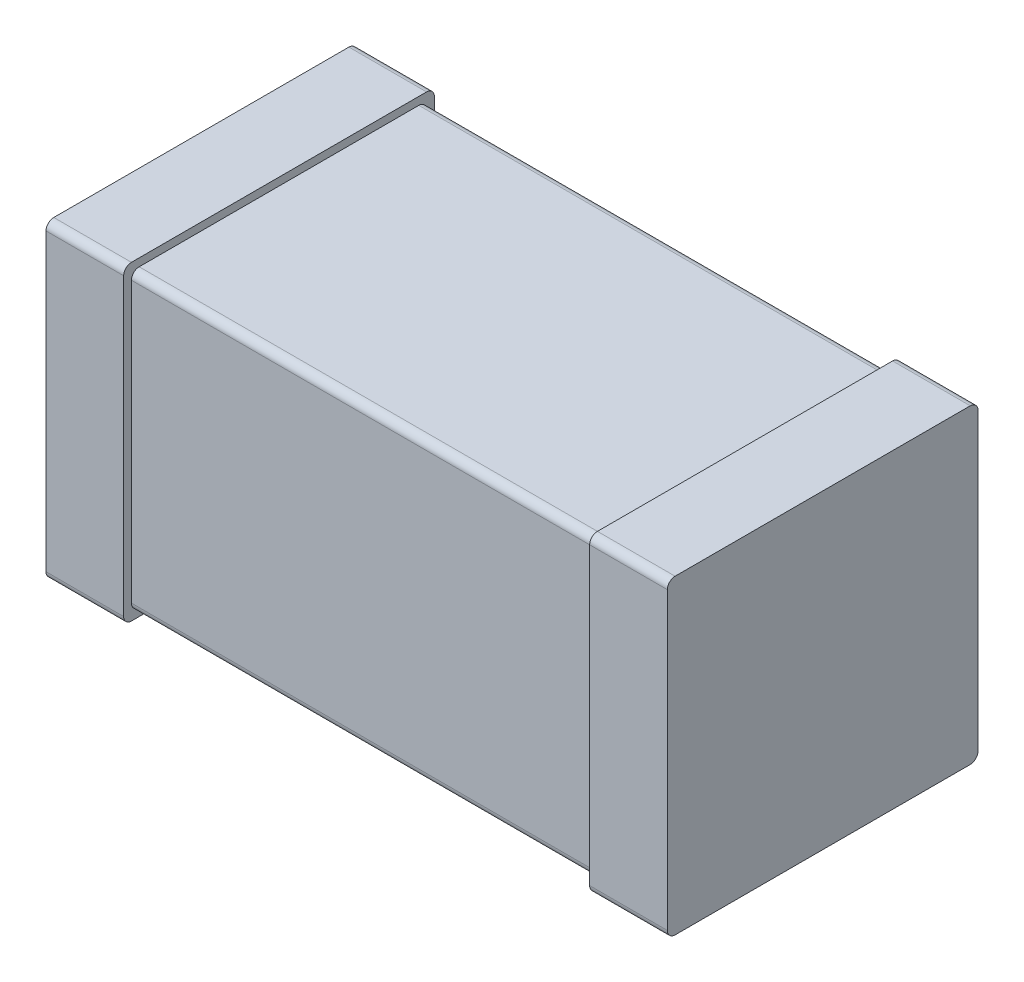
ISO-10303-21;
HEADER;
FILE_DESCRIPTION(('STEP AP214'),'2;1');
FILE_NAME('part.step','',(''),(''),'','','');
FILE_SCHEMA(('AUTOMOTIVE_DESIGN { 1 0 10303 214 1 1 1 1 }'));
ENDSEC;
DATA;
#1=APPLICATION_CONTEXT('core data for automotive mechanical design processes');
#2=APPLICATION_PROTOCOL_DEFINITION('international standard','automotive_design',2000,#1);
#3=PRODUCT_CONTEXT('',#1,'mechanical');
#4=PRODUCT('Part','Part','',(#3));
#5=PRODUCT_RELATED_PRODUCT_CATEGORY('part','',(#4));
#6=PRODUCT_DEFINITION_FORMATION('','',#4);
#7=PRODUCT_DEFINITION_CONTEXT('part definition',#1,'design');
#8=PRODUCT_DEFINITION('design','',#6,#7);
#9=PRODUCT_DEFINITION_SHAPE('','',#8);
#10=(LENGTH_UNIT() NAMED_UNIT(*) SI_UNIT(.MILLI.,.METRE.));
#11=(NAMED_UNIT(*) PLANE_ANGLE_UNIT() SI_UNIT($,.RADIAN.));
#12=(NAMED_UNIT(*) SI_UNIT($,.STERADIAN.) SOLID_ANGLE_UNIT());
#13=UNCERTAINTY_MEASURE_WITH_UNIT(LENGTH_MEASURE(1.E-05),#10,'distance_accuracy_value','');
#14=(GEOMETRIC_REPRESENTATION_CONTEXT(3) GLOBAL_UNCERTAINTY_ASSIGNED_CONTEXT((#13)) GLOBAL_UNIT_ASSIGNED_CONTEXT((#10,
#11,#12)) REPRESENTATION_CONTEXT('',''));
#15=CARTESIAN_POINT('',(0.,0.,0.));
#16=DIRECTION('',(0.,0.,1.));
#17=DIRECTION('',(1.,0.,0.));
#18=AXIS2_PLACEMENT_3D('',#15,#16,#17);
#19=CARTESIAN_POINT('',(1.6,-0.8,0.));
#20=DIRECTION('',(1.,0.,0.));
#21=DIRECTION('',(0.,1.,0.));
#22=AXIS2_PLACEMENT_3D('',#19,#20,#21);
#23=PLANE('',#22);
#24=DIRECTION('',(0.,0.,1.));
#25=VECTOR('',#24,1.);
#26=CARTESIAN_POINT('',(1.6,-0.8,0.));
#27=LINE('',#26,#25);
#28=CARTESIAN_POINT('',(1.6,-0.8,0.04));
#29=VERTEX_POINT('',#28);
#30=CARTESIAN_POINT('',(1.6,-0.8,1.56));
#31=VERTEX_POINT('',#30);
#32=EDGE_CURVE('E304',#29,#31,#27,.T.);
#33=ORIENTED_EDGE('',*,*,#32,.F.);
#34=CARTESIAN_POINT('',(1.6,-0.76,0.04));
#35=DIRECTION('',(1.,0.,0.));
#36=DIRECTION('',(0.,0.,1.));
#37=AXIS2_PLACEMENT_3D('',#34,#35,#36);
#38=CIRCLE('',#37,0.04);
#39=CARTESIAN_POINT('',(1.6,-0.76,0.));
#40=VERTEX_POINT('',#39);
#41=EDGE_CURVE('E310',#29,#40,#38,.T.);
#42=ORIENTED_EDGE('',*,*,#41,.T.);
#43=DIRECTION('',(0.,1.,0.));
#44=VECTOR('',#43,1.);
#45=CARTESIAN_POINT('',(1.6,-0.8,0.));
#46=LINE('',#45,#44);
#47=CARTESIAN_POINT('',(1.6,0.76,0.));
#48=VERTEX_POINT('',#47);
#49=EDGE_CURVE('E319',#40,#48,#46,.T.);
#50=ORIENTED_EDGE('',*,*,#49,.T.);
#51=CARTESIAN_POINT('',(1.6,0.76,0.04));
#52=DIRECTION('',(-1.,0.,0.));
#53=DIRECTION('',(0.,0.,1.));
#54=AXIS2_PLACEMENT_3D('',#51,#52,#53);
#55=CIRCLE('',#54,0.04);
#56=CARTESIAN_POINT('',(1.6,0.8,0.04));
#57=VERTEX_POINT('',#56);
#58=EDGE_CURVE('E278',#57,#48,#55,.T.);
#59=ORIENTED_EDGE('',*,*,#58,.F.);
#60=DIRECTION('',(0.,0.,1.));
#61=VECTOR('',#60,1.);
#62=CARTESIAN_POINT('',(1.6,0.8,0.));
#63=LINE('',#62,#61);
#64=CARTESIAN_POINT('',(1.6,0.8,1.56));
#65=VERTEX_POINT('',#64);
#66=EDGE_CURVE('E11',#57,#65,#63,.T.);
#67=ORIENTED_EDGE('',*,*,#66,.T.);
#68=CARTESIAN_POINT('',(1.6,0.76,1.56));
#69=DIRECTION('',(1.,0.,0.));
#70=DIRECTION('',(0.,0.,1.));
#71=AXIS2_PLACEMENT_3D('',#68,#69,#70);
#72=CIRCLE('',#71,0.04);
#73=CARTESIAN_POINT('',(1.6,0.76,1.6));
#74=VERTEX_POINT('',#73);
#75=EDGE_CURVE('E281',#65,#74,#72,.T.);
#76=ORIENTED_EDGE('',*,*,#75,.T.);
#77=DIRECTION('',(0.,1.,0.));
#78=VECTOR('',#77,1.);
#79=CARTESIAN_POINT('',(1.6,-0.8,1.6));
#80=LINE('',#79,#78);
#81=CARTESIAN_POINT('',(1.6,-0.76,1.6));
#82=VERTEX_POINT('',#81);
#83=EDGE_CURVE('E415',#82,#74,#80,.T.);
#84=ORIENTED_EDGE('',*,*,#83,.F.);
#85=CARTESIAN_POINT('',(1.6,-0.76,1.56));
#86=DIRECTION('',(-1.,0.,0.));
#87=DIRECTION('',(0.,0.,1.));
#88=AXIS2_PLACEMENT_3D('',#85,#86,#87);
#89=CIRCLE('',#88,0.04);
#90=EDGE_CURVE('E314',#31,#82,#89,.T.);
#91=ORIENTED_EDGE('',*,*,#90,.F.);
#92=EDGE_LOOP('',(#33,#42,#50,#59,#67,#76,#84,#91));
#93=FACE_BOUND('',#92,.T.);
#94=ADVANCED_FACE('F16',(#93),#23,.T.);
#95=CARTESIAN_POINT('',(1.2,0.8,0.));
#96=DIRECTION('',(0.,1.,0.));
#97=DIRECTION('',(1.,0.,0.));
#98=AXIS2_PLACEMENT_3D('',#95,#96,#97);
#99=PLANE('',#98);
#100=ORIENTED_EDGE('',*,*,#66,.F.);
#101=DIRECTION('',(1.,0.,0.));
#102=VECTOR('',#101,1.);
#103=CARTESIAN_POINT('',(1.2,0.8,0.04));
#104=LINE('',#103,#102);
#105=CARTESIAN_POINT('',(1.2,0.8,0.04));
#106=VERTEX_POINT('',#105);
#107=EDGE_CURVE('E282',#106,#57,#104,.T.);
#108=ORIENTED_EDGE('',*,*,#107,.F.);
#109=DIRECTION('',(0.,0.,1.));
#110=VECTOR('',#109,1.);
#111=CARTESIAN_POINT('',(1.2,0.8,0.));
#112=LINE('',#111,#110);
#113=CARTESIAN_POINT('',(1.2,0.8,1.56));
#114=VERTEX_POINT('',#113);
#115=EDGE_CURVE('E261',#106,#114,#112,.T.);
#116=ORIENTED_EDGE('',*,*,#115,.T.);
#117=DIRECTION('',(1.,0.,0.));
#118=VECTOR('',#117,1.);
#119=CARTESIAN_POINT('',(1.2,0.8,1.56));
#120=LINE('',#119,#118);
#121=EDGE_CURVE('E27',#114,#65,#120,.T.);
#122=ORIENTED_EDGE('',*,*,#121,.T.);
#123=EDGE_LOOP('',(#100,#108,#116,#122));
#124=FACE_BOUND('',#123,.T.);
#125=ADVANCED_FACE('F523',(#124),#99,.T.);
#126=CARTESIAN_POINT('',(1.2,0.76,1.56));
#127=DIRECTION('',(1.,0.,0.));
#128=DIRECTION('',(0.,1.,0.));
#129=AXIS2_PLACEMENT_3D('',#126,#127,#128);
#130=CYLINDRICAL_SURFACE('',#129,0.04);
#131=CARTESIAN_POINT('',(1.2,0.76,1.56));
#132=DIRECTION('',(1.,0.,0.));
#133=DIRECTION('',(0.,0.,1.));
#134=AXIS2_PLACEMENT_3D('',#131,#132,#133);
#135=CIRCLE('',#134,0.04);
#136=CARTESIAN_POINT('',(1.2,0.76,1.6));
#137=VERTEX_POINT('',#136);
#138=EDGE_CURVE('E257',#114,#137,#135,.T.);
#139=ORIENTED_EDGE('',*,*,#138,.T.);
#140=DIRECTION('',(1.,0.,0.));
#141=VECTOR('',#140,1.);
#142=CARTESIAN_POINT('',(1.2,0.76,1.6));
#143=LINE('',#142,#141);
#144=EDGE_CURVE('E332',#137,#74,#143,.T.);
#145=ORIENTED_EDGE('',*,*,#144,.T.);
#146=ORIENTED_EDGE('',*,*,#75,.F.);
#147=ORIENTED_EDGE('',*,*,#121,.F.);
#148=EDGE_LOOP('',(#139,#145,#146,#147));
#149=FACE_BOUND('',#148,.T.);
#150=ADVANCED_FACE('F581',(#149),#130,.T.);
#151=CARTESIAN_POINT('',(1.2,0.76,0.04));
#152=DIRECTION('',(1.,0.,0.));
#153=DIRECTION('',(0.,1.,0.));
#154=AXIS2_PLACEMENT_3D('',#151,#152,#153);
#155=CYLINDRICAL_SURFACE('',#154,0.04);
#156=ORIENTED_EDGE('',*,*,#107,.T.);
#157=ORIENTED_EDGE('',*,*,#58,.T.);
#158=DIRECTION('',(1.,0.,0.));
#159=VECTOR('',#158,1.);
#160=CARTESIAN_POINT('',(1.2,0.76,0.));
#161=LINE('',#160,#159);
#162=CARTESIAN_POINT('',(1.2,0.76,0.));
#163=VERTEX_POINT('',#162);
#164=EDGE_CURVE('E315',#163,#48,#161,.T.);
#165=ORIENTED_EDGE('',*,*,#164,.F.);
#166=CARTESIAN_POINT('',(1.2,0.76,0.04));
#167=DIRECTION('',(-1.,0.,0.));
#168=DIRECTION('',(0.,0.,1.));
#169=AXIS2_PLACEMENT_3D('',#166,#167,#168);
#170=CIRCLE('',#169,0.04);
#171=EDGE_CURVE('E408',#106,#163,#170,.T.);
#172=ORIENTED_EDGE('',*,*,#171,.F.);
#173=EDGE_LOOP('',(#156,#157,#165,#172));
#174=FACE_BOUND('',#173,.T.);
#175=ADVANCED_FACE('F488',(#174),#155,.T.);
#176=CARTESIAN_POINT('',(1.2,-0.8,1.6));
#177=DIRECTION('',(0.,0.,1.));
#178=DIRECTION('',(1.,0.,0.));
#179=AXIS2_PLACEMENT_3D('',#176,#177,#178);
#180=PLANE('',#179);
#181=DIRECTION('',(0.,1.,0.));
#182=VECTOR('',#181,1.);
#183=CARTESIAN_POINT('',(1.2,-0.8,1.6));
#184=LINE('',#183,#182);
#185=CARTESIAN_POINT('',(1.2,-0.76,1.6));
#186=VERTEX_POINT('',#185);
#187=EDGE_CURVE('E262',#186,#137,#184,.T.);
#188=ORIENTED_EDGE('',*,*,#187,.F.);
#189=DIRECTION('',(1.,0.,0.));
#190=VECTOR('',#189,1.);
#191=CARTESIAN_POINT('',(1.2,-0.76,1.6));
#192=LINE('',#191,#190);
#193=EDGE_CURVE('E320',#186,#82,#192,.T.);
#194=ORIENTED_EDGE('',*,*,#193,.T.);
#195=ORIENTED_EDGE('',*,*,#83,.T.);
#196=ORIENTED_EDGE('',*,*,#144,.F.);
#197=EDGE_LOOP('',(#188,#194,#195,#196));
#198=FACE_BOUND('',#197,.T.);
#199=ADVANCED_FACE('F574',(#198),#180,.T.);
#200=CARTESIAN_POINT('',(1.2,-0.8,0.));
#201=DIRECTION('',(0.,0.,1.));
#202=DIRECTION('',(1.,0.,0.));
#203=AXIS2_PLACEMENT_3D('',#200,#201,#202);
#204=PLANE('',#203);
#205=ORIENTED_EDGE('',*,*,#164,.T.);
#206=ORIENTED_EDGE('',*,*,#49,.F.);
#207=DIRECTION('',(1.,0.,0.));
#208=VECTOR('',#207,1.);
#209=CARTESIAN_POINT('',(1.2,-0.76,0.));
#210=LINE('',#209,#208);
#211=CARTESIAN_POINT('',(1.2,-0.76,0.));
#212=VERTEX_POINT('',#211);
#213=EDGE_CURVE('E308',#212,#40,#210,.T.);
#214=ORIENTED_EDGE('',*,*,#213,.F.);
#215=DIRECTION('',(0.,1.,0.));
#216=VECTOR('',#215,1.);
#217=CARTESIAN_POINT('',(1.2,-0.8,0.));
#218=LINE('',#217,#216);
#219=EDGE_CURVE('E348',#212,#163,#218,.T.);
#220=ORIENTED_EDGE('',*,*,#219,.T.);
#221=EDGE_LOOP('',(#205,#206,#214,#220));
#222=FACE_BOUND('',#221,.T.);
#223=ADVANCED_FACE('F480',(#222),#204,.F.);
#224=CARTESIAN_POINT('',(1.2,-0.76,1.56));
#225=DIRECTION('',(1.,0.,0.));
#226=DIRECTION('',(0.,-1.,0.));
#227=AXIS2_PLACEMENT_3D('',#224,#225,#226);
#228=CYLINDRICAL_SURFACE('',#227,0.04);
#229=DIRECTION('',(1.,0.,0.));
#230=VECTOR('',#229,1.);
#231=CARTESIAN_POINT('',(1.2,-0.8,1.56));
#232=LINE('',#231,#230);
#233=CARTESIAN_POINT('',(1.2,-0.8,1.56));
#234=VERTEX_POINT('',#233);
#235=EDGE_CURVE('E243',#234,#31,#232,.T.);
#236=ORIENTED_EDGE('',*,*,#235,.T.);
#237=ORIENTED_EDGE('',*,*,#90,.T.);
#238=ORIENTED_EDGE('',*,*,#193,.F.);
#239=CARTESIAN_POINT('',(1.2,-0.76,1.56));
#240=DIRECTION('',(-1.,0.,0.));
#241=DIRECTION('',(0.,0.,1.));
#242=AXIS2_PLACEMENT_3D('',#239,#240,#241);
#243=CIRCLE('',#242,0.04);
#244=EDGE_CURVE('E252',#234,#186,#243,.T.);
#245=ORIENTED_EDGE('',*,*,#244,.F.);
#246=EDGE_LOOP('',(#236,#237,#238,#245));
#247=FACE_BOUND('',#246,.T.);
#248=ADVANCED_FACE('F557',(#247),#228,.T.);
#249=CARTESIAN_POINT('',(1.2,-0.76,0.04));
#250=DIRECTION('',(1.,0.,0.));
#251=DIRECTION('',(0.,-1.,0.));
#252=AXIS2_PLACEMENT_3D('',#249,#250,#251);
#253=CYLINDRICAL_SURFACE('',#252,0.04);
#254=CARTESIAN_POINT('',(1.2,-0.76,0.04));
#255=DIRECTION('',(1.,0.,0.));
#256=DIRECTION('',(0.,0.,1.));
#257=AXIS2_PLACEMENT_3D('',#254,#255,#256);
#258=CIRCLE('',#257,0.04);
#259=CARTESIAN_POINT('',(1.2,-0.8,0.04));
#260=VERTEX_POINT('',#259);
#261=EDGE_CURVE('E343',#260,#212,#258,.T.);
#262=ORIENTED_EDGE('',*,*,#261,.T.);
#263=ORIENTED_EDGE('',*,*,#213,.T.);
#264=ORIENTED_EDGE('',*,*,#41,.F.);
#265=DIRECTION('',(1.,0.,0.));
#266=VECTOR('',#265,1.);
#267=CARTESIAN_POINT('',(1.2,-0.8,0.04));
#268=LINE('',#267,#266);
#269=EDGE_CURVE('E309',#260,#29,#268,.T.);
#270=ORIENTED_EDGE('',*,*,#269,.F.);
#271=EDGE_LOOP('',(#262,#263,#264,#270));
#272=FACE_BOUND('',#271,.T.);
#273=ADVANCED_FACE('F562',(#272),#253,.T.);
#274=CARTESIAN_POINT('',(1.2,-0.8,0.));
#275=DIRECTION('',(0.,1.,0.));
#276=DIRECTION('',(1.,0.,0.));
#277=AXIS2_PLACEMENT_3D('',#274,#275,#276);
#278=PLANE('',#277);
#279=ORIENTED_EDGE('',*,*,#235,.F.);
#280=DIRECTION('',(0.,0.,1.));
#281=VECTOR('',#280,1.);
#282=CARTESIAN_POINT('',(1.2,-0.8,0.));
#283=LINE('',#282,#281);
#284=EDGE_CURVE('E347',#260,#234,#283,.T.);
#285=ORIENTED_EDGE('',*,*,#284,.F.);
#286=ORIENTED_EDGE('',*,*,#269,.T.);
#287=ORIENTED_EDGE('',*,*,#32,.T.);
#288=EDGE_LOOP('',(#279,#285,#286,#287));
#289=FACE_BOUND('',#288,.T.);
#290=ADVANCED_FACE('F681',(#289),#278,.F.);
#291=CARTESIAN_POINT('',(1.2,-0.8,0.));
#292=DIRECTION('',(1.,0.,0.));
#293=DIRECTION('',(0.,1.,0.));
#294=AXIS2_PLACEMENT_3D('',#291,#292,#293);
#295=PLANE('',#294);
#296=DIRECTION('',(0.,1.,0.));
#297=VECTOR('',#296,1.);
#298=CARTESIAN_POINT('',(1.2,-0.76,0.04));
#299=LINE('',#298,#297);
#300=CARTESIAN_POINT('',(1.2,-0.72,0.04));
#301=VERTEX_POINT('',#300);
#302=CARTESIAN_POINT('',(1.2,0.72,0.04));
#303=VERTEX_POINT('',#302);
#304=EDGE_CURVE('E326',#301,#303,#299,.T.);
#305=ORIENTED_EDGE('',*,*,#304,.T.);
#306=CARTESIAN_POINT('',(1.2,0.72,0.08));
#307=DIRECTION('',(-1.,0.,0.));
#308=DIRECTION('',(0.,0.,1.));
#309=AXIS2_PLACEMENT_3D('',#306,#307,#308);
#310=CIRCLE('',#309,0.04);
#311=CARTESIAN_POINT('',(1.2,0.76,0.08));
#312=VERTEX_POINT('',#311);
#313=EDGE_CURVE('E288',#312,#303,#310,.T.);
#314=ORIENTED_EDGE('',*,*,#313,.F.);
#315=DIRECTION('',(0.,0.,1.));
#316=VECTOR('',#315,1.);
#317=CARTESIAN_POINT('',(1.2,0.76,0.04));
#318=LINE('',#317,#316);
#319=CARTESIAN_POINT('',(1.2,0.76,1.52));
#320=VERTEX_POINT('',#319);
#321=EDGE_CURVE('E291',#312,#320,#318,.T.);
#322=ORIENTED_EDGE('',*,*,#321,.T.);
#323=CARTESIAN_POINT('',(1.2,0.72,1.52));
#324=DIRECTION('',(1.,0.,0.));
#325=DIRECTION('',(0.,0.,1.));
#326=AXIS2_PLACEMENT_3D('',#323,#324,#325);
#327=CIRCLE('',#326,0.04);
#328=CARTESIAN_POINT('',(1.2,0.72,1.56));
#329=VERTEX_POINT('',#328);
#330=EDGE_CURVE('E342',#320,#329,#327,.T.);
#331=ORIENTED_EDGE('',*,*,#330,.T.);
#332=DIRECTION('',(0.,1.,0.));
#333=VECTOR('',#332,1.);
#334=CARTESIAN_POINT('',(1.2,-0.76,1.56));
#335=LINE('',#334,#333);
#336=CARTESIAN_POINT('',(1.2,-0.72,1.56));
#337=VERTEX_POINT('',#336);
#338=EDGE_CURVE('E341',#337,#329,#335,.T.);
#339=ORIENTED_EDGE('',*,*,#338,.F.);
#340=CARTESIAN_POINT('',(1.2,-0.72,1.52));
#341=DIRECTION('',(-1.,0.,0.));
#342=DIRECTION('',(0.,0.,1.));
#343=AXIS2_PLACEMENT_3D('',#340,#341,#342);
#344=CIRCLE('',#343,0.04);
#345=CARTESIAN_POINT('',(1.2,-0.76,1.52));
#346=VERTEX_POINT('',#345);
#347=EDGE_CURVE('E253',#346,#337,#344,.T.);
#348=ORIENTED_EDGE('',*,*,#347,.F.);
#349=DIRECTION('',(0.,0.,1.));
#350=VECTOR('',#349,1.);
#351=CARTESIAN_POINT('',(1.2,-0.76,0.04));
#352=LINE('',#351,#350);
#353=CARTESIAN_POINT('',(1.2,-0.76,0.08));
#354=VERTEX_POINT('',#353);
#355=EDGE_CURVE('E248',#354,#346,#352,.T.);
#356=ORIENTED_EDGE('',*,*,#355,.F.);
#357=CARTESIAN_POINT('',(1.2,-0.72,0.08));
#358=DIRECTION('',(1.,0.,0.));
#359=DIRECTION('',(0.,0.,1.));
#360=AXIS2_PLACEMENT_3D('',#357,#358,#359);
#361=CIRCLE('',#360,0.04);
#362=EDGE_CURVE('E276',#354,#301,#361,.T.);
#363=ORIENTED_EDGE('',*,*,#362,.T.);
#364=EDGE_LOOP('',(#305,#314,#322,#331,#339,#348,#356,#363));
#365=FACE_BOUND('',#364,.T.);
#366=ORIENTED_EDGE('',*,*,#244,.T.);
#367=ORIENTED_EDGE('',*,*,#187,.T.);
#368=ORIENTED_EDGE('',*,*,#138,.F.);
#369=ORIENTED_EDGE('',*,*,#115,.F.);
#370=ORIENTED_EDGE('',*,*,#171,.T.);
#371=ORIENTED_EDGE('',*,*,#219,.F.);
#372=ORIENTED_EDGE('',*,*,#261,.F.);
#373=ORIENTED_EDGE('',*,*,#284,.T.);
#374=EDGE_LOOP('',(#366,#367,#368,#369,#370,#371,#372,#373));
#375=FACE_BOUND('',#374,.T.);
#376=ADVANCED_FACE('F485',(#365,#375),#295,.F.);
#377=CARTESIAN_POINT('',(-1.2,-0.76,0.04));
#378=DIRECTION('',(0.,1.,0.));
#379=DIRECTION('',(1.,0.,0.));
#380=AXIS2_PLACEMENT_3D('',#377,#378,#379);
#381=PLANE('',#380);
#382=DIRECTION('',(1.,0.,0.));
#383=VECTOR('',#382,1.);
#384=CARTESIAN_POINT('',(-1.2,-0.76,1.52));
#385=LINE('',#384,#383);
#386=CARTESIAN_POINT('',(-1.2,-0.76,1.52));
#387=VERTEX_POINT('',#386);
#388=EDGE_CURVE('E461',#387,#346,#385,.T.);
#389=ORIENTED_EDGE('',*,*,#388,.F.);
#390=DIRECTION('',(0.,0.,1.));
#391=VECTOR('',#390,1.);
#392=CARTESIAN_POINT('',(-1.2,-0.76,0.04));
#393=LINE('',#392,#391);
#394=CARTESIAN_POINT('',(-1.2,-0.76,0.08));
#395=VERTEX_POINT('',#394);
#396=EDGE_CURVE('E299',#395,#387,#393,.T.);
#397=ORIENTED_EDGE('',*,*,#396,.F.);
#398=DIRECTION('',(1.,0.,0.));
#399=VECTOR('',#398,1.);
#400=CARTESIAN_POINT('',(-1.2,-0.76,0.08));
#401=LINE('',#400,#399);
#402=EDGE_CURVE('E442',#395,#354,#401,.T.);
#403=ORIENTED_EDGE('',*,*,#402,.T.);
#404=ORIENTED_EDGE('',*,*,#355,.T.);
#405=EDGE_LOOP('',(#389,#397,#403,#404));
#406=FACE_BOUND('',#405,.T.);
#407=ADVANCED_FACE('F543',(#406),#381,.F.);
#408=CARTESIAN_POINT('',(-1.2,-0.72,1.52));
#409=DIRECTION('',(1.,0.,0.));
#410=DIRECTION('',(0.,-1.,0.));
#411=AXIS2_PLACEMENT_3D('',#408,#409,#410);
#412=CYLINDRICAL_SURFACE('',#411,0.04);
#413=ORIENTED_EDGE('',*,*,#388,.T.);
#414=ORIENTED_EDGE('',*,*,#347,.T.);
#415=DIRECTION('',(1.,0.,0.));
#416=VECTOR('',#415,1.);
#417=CARTESIAN_POINT('',(-1.2,-0.72,1.56));
#418=LINE('',#417,#416);
#419=CARTESIAN_POINT('',(-1.2,-0.72,1.56));
#420=VERTEX_POINT('',#419);
#421=EDGE_CURVE('E337',#420,#337,#418,.T.);
#422=ORIENTED_EDGE('',*,*,#421,.F.);
#423=CARTESIAN_POINT('',(-1.2,-0.72,1.52));
#424=DIRECTION('',(-1.,0.,0.));
#425=DIRECTION('',(0.,0.,1.));
#426=AXIS2_PLACEMENT_3D('',#423,#424,#425);
#427=CIRCLE('',#426,0.04);
#428=EDGE_CURVE('E303',#387,#420,#427,.T.);
#429=ORIENTED_EDGE('',*,*,#428,.F.);
#430=EDGE_LOOP('',(#413,#414,#422,#429));
#431=FACE_BOUND('',#430,.T.);
#432=ADVANCED_FACE('F548',(#431),#412,.T.);
#433=CARTESIAN_POINT('',(-1.2,-0.76,1.56));
#434=DIRECTION('',(0.,0.,1.));
#435=DIRECTION('',(1.,0.,0.));
#436=AXIS2_PLACEMENT_3D('',#433,#434,#435);
#437=PLANE('',#436);
#438=DIRECTION('',(0.,1.,0.));
#439=VECTOR('',#438,1.);
#440=CARTESIAN_POINT('',(-1.2,-0.76,1.56));
#441=LINE('',#440,#439);
#442=CARTESIAN_POINT('',(-1.2,0.72,1.56));
#443=VERTEX_POINT('',#442);
#444=EDGE_CURVE('E387',#420,#443,#441,.T.);
#445=ORIENTED_EDGE('',*,*,#444,.F.);
#446=ORIENTED_EDGE('',*,*,#421,.T.);
#447=ORIENTED_EDGE('',*,*,#338,.T.);
#448=DIRECTION('',(1.,0.,0.));
#449=VECTOR('',#448,1.);
#450=CARTESIAN_POINT('',(-1.2,0.72,1.56));
#451=LINE('',#450,#449);
#452=EDGE_CURVE('E355',#443,#329,#451,.T.);
#453=ORIENTED_EDGE('',*,*,#452,.F.);
#454=EDGE_LOOP('',(#445,#446,#447,#453));
#455=FACE_BOUND('',#454,.T.);
#456=ADVANCED_FACE('F607',(#455),#437,.T.);
#457=CARTESIAN_POINT('',(-1.2,0.72,1.52));
#458=DIRECTION('',(1.,0.,0.));
#459=DIRECTION('',(0.,1.,0.));
#460=AXIS2_PLACEMENT_3D('',#457,#458,#459);
#461=CYLINDRICAL_SURFACE('',#460,0.04);
#462=CARTESIAN_POINT('',(-1.2,0.72,1.52));
#463=DIRECTION('',(1.,0.,0.));
#464=DIRECTION('',(0.,0.,1.));
#465=AXIS2_PLACEMENT_3D('',#462,#463,#464);
#466=CIRCLE('',#465,0.04);
#467=CARTESIAN_POINT('',(-1.2,0.76,1.52));
#468=VERTEX_POINT('',#467);
#469=EDGE_CURVE('E382',#468,#443,#466,.T.);
#470=ORIENTED_EDGE('',*,*,#469,.T.);
#471=ORIENTED_EDGE('',*,*,#452,.T.);
#472=ORIENTED_EDGE('',*,*,#330,.F.);
#473=DIRECTION('',(1.,0.,0.));
#474=VECTOR('',#473,1.);
#475=CARTESIAN_POINT('',(-1.2,0.76,1.52));
#476=LINE('',#475,#474);
#477=EDGE_CURVE('E352',#468,#320,#476,.T.);
#478=ORIENTED_EDGE('',*,*,#477,.F.);
#479=EDGE_LOOP('',(#470,#471,#472,#478));
#480=FACE_BOUND('',#479,.T.);
#481=ADVANCED_FACE('F612',(#480),#461,.T.);
#482=CARTESIAN_POINT('',(-1.2,0.76,0.04));
#483=DIRECTION('',(0.,1.,0.));
#484=DIRECTION('',(1.,0.,0.));
#485=AXIS2_PLACEMENT_3D('',#482,#483,#484);
#486=PLANE('',#485);
#487=ORIENTED_EDGE('',*,*,#321,.F.);
#488=DIRECTION('',(1.,0.,0.));
#489=VECTOR('',#488,1.);
#490=CARTESIAN_POINT('',(-1.2,0.76,0.08));
#491=LINE('',#490,#489);
#492=CARTESIAN_POINT('',(-1.2,0.76,0.08));
#493=VERTEX_POINT('',#492);
#494=EDGE_CURVE('E292',#493,#312,#491,.T.);
#495=ORIENTED_EDGE('',*,*,#494,.F.);
#496=DIRECTION('',(0.,0.,1.));
#497=VECTOR('',#496,1.);
#498=CARTESIAN_POINT('',(-1.2,0.76,0.04));
#499=LINE('',#498,#497);
#500=EDGE_CURVE('E386',#493,#468,#499,.T.);
#501=ORIENTED_EDGE('',*,*,#500,.T.);
#502=ORIENTED_EDGE('',*,*,#477,.T.);
#503=EDGE_LOOP('',(#487,#495,#501,#502));
#504=FACE_BOUND('',#503,.T.);
#505=ADVANCED_FACE('F734',(#504),#486,.T.);
#506=CARTESIAN_POINT('',(-1.2,0.72,0.08));
#507=DIRECTION('',(1.,0.,0.));
#508=DIRECTION('',(0.,1.,0.));
#509=AXIS2_PLACEMENT_3D('',#506,#507,#508);
#510=CYLINDRICAL_SURFACE('',#509,0.04);
#511=ORIENTED_EDGE('',*,*,#494,.T.);
#512=ORIENTED_EDGE('',*,*,#313,.T.);
#513=DIRECTION('',(1.,0.,0.));
#514=VECTOR('',#513,1.);
#515=CARTESIAN_POINT('',(-1.2,0.72,0.04));
#516=LINE('',#515,#514);
#517=CARTESIAN_POINT('',(-1.2,0.72,0.04));
#518=VERTEX_POINT('',#517);
#519=EDGE_CURVE('E439',#518,#303,#516,.T.);
#520=ORIENTED_EDGE('',*,*,#519,.F.);
#521=CARTESIAN_POINT('',(-1.2,0.72,0.08));
#522=DIRECTION('',(-1.,0.,0.));
#523=DIRECTION('',(0.,0.,1.));
#524=AXIS2_PLACEMENT_3D('',#521,#522,#523);
#525=CIRCLE('',#524,0.04);
#526=EDGE_CURVE('E395',#493,#518,#525,.T.);
#527=ORIENTED_EDGE('',*,*,#526,.F.);
#528=EDGE_LOOP('',(#511,#512,#520,#527));
#529=FACE_BOUND('',#528,.T.);
#530=ADVANCED_FACE('F704',(#529),#510,.T.);
#531=CARTESIAN_POINT('',(-1.2,-0.76,0.04));
#532=DIRECTION('',(0.,0.,1.));
#533=DIRECTION('',(1.,0.,0.));
#534=AXIS2_PLACEMENT_3D('',#531,#532,#533);
#535=PLANE('',#534);
#536=ORIENTED_EDGE('',*,*,#519,.T.);
#537=ORIENTED_EDGE('',*,*,#304,.F.);
#538=DIRECTION('',(1.,0.,0.));
#539=VECTOR('',#538,1.);
#540=CARTESIAN_POINT('',(-1.2,-0.72,0.04));
#541=LINE('',#540,#539);
#542=CARTESIAN_POINT('',(-1.2,-0.72,0.04));
#543=VERTEX_POINT('',#542);
#544=EDGE_CURVE('E272',#543,#301,#541,.T.);
#545=ORIENTED_EDGE('',*,*,#544,.F.);
#546=DIRECTION('',(0.,1.,0.));
#547=VECTOR('',#546,1.);
#548=CARTESIAN_POINT('',(-1.2,-0.76,0.04));
#549=LINE('',#548,#547);
#550=EDGE_CURVE('E277',#543,#518,#549,.T.);
#551=ORIENTED_EDGE('',*,*,#550,.T.);
#552=EDGE_LOOP('',(#536,#537,#545,#551));
#553=FACE_BOUND('',#552,.T.);
#554=ADVANCED_FACE('F698',(#553),#535,.F.);
#555=CARTESIAN_POINT('',(-1.2,-0.72,0.08));
#556=DIRECTION('',(1.,0.,0.));
#557=DIRECTION('',(0.,-1.,0.));
#558=AXIS2_PLACEMENT_3D('',#555,#556,#557);
#559=CYLINDRICAL_SURFACE('',#558,0.04);
#560=CARTESIAN_POINT('',(-1.2,-0.72,0.08));
#561=DIRECTION('',(1.,0.,0.));
#562=DIRECTION('',(0.,0.,1.));
#563=AXIS2_PLACEMENT_3D('',#560,#561,#562);
#564=CIRCLE('',#563,0.04);
#565=EDGE_CURVE('E271',#395,#543,#564,.T.);
#566=ORIENTED_EDGE('',*,*,#565,.T.);
#567=ORIENTED_EDGE('',*,*,#544,.T.);
#568=ORIENTED_EDGE('',*,*,#362,.F.);
#569=ORIENTED_EDGE('',*,*,#402,.F.);
#570=EDGE_LOOP('',(#566,#567,#568,#569));
#571=FACE_BOUND('',#570,.T.);
#572=ADVANCED_FACE('F703',(#571),#559,.T.);
#573=CARTESIAN_POINT('',(-1.2,-0.8,0.));
#574=DIRECTION('',(1.,0.,0.));
#575=DIRECTION('',(0.,1.,0.));
#576=AXIS2_PLACEMENT_3D('',#573,#574,#575);
#577=PLANE('',#576);
#578=ORIENTED_EDGE('',*,*,#565,.F.);
#579=ORIENTED_EDGE('',*,*,#396,.T.);
#580=ORIENTED_EDGE('',*,*,#428,.T.);
#581=ORIENTED_EDGE('',*,*,#444,.T.);
#582=ORIENTED_EDGE('',*,*,#469,.F.);
#583=ORIENTED_EDGE('',*,*,#500,.F.);
#584=ORIENTED_EDGE('',*,*,#526,.T.);
#585=ORIENTED_EDGE('',*,*,#550,.F.);
#586=EDGE_LOOP('',(#578,#579,#580,#581,#582,#583,#584,#585));
#587=FACE_BOUND('',#586,.T.);
#588=DIRECTION('',(0.,0.,1.));
#589=VECTOR('',#588,1.);
#590=CARTESIAN_POINT('',(-1.2,-0.8,0.));
#591=LINE('',#590,#589);
#592=CARTESIAN_POINT('',(-1.2,-0.8,0.04));
#593=VERTEX_POINT('',#592);
#594=CARTESIAN_POINT('',(-1.2,-0.8,1.56));
#595=VERTEX_POINT('',#594);
#596=EDGE_CURVE('E293',#593,#595,#591,.T.);
#597=ORIENTED_EDGE('',*,*,#596,.F.);
#598=CARTESIAN_POINT('',(-1.2,-0.76,0.04));
#599=DIRECTION('',(1.,0.,0.));
#600=DIRECTION('',(0.,0.,1.));
#601=AXIS2_PLACEMENT_3D('',#598,#599,#600);
#602=CIRCLE('',#601,0.04);
#603=CARTESIAN_POINT('',(-1.2,-0.76,0.));
#604=VERTEX_POINT('',#603);
#605=EDGE_CURVE('E839',#593,#604,#602,.T.);
#606=ORIENTED_EDGE('',*,*,#605,.T.);
#607=DIRECTION('',(0.,1.,0.));
#608=VECTOR('',#607,1.);
#609=CARTESIAN_POINT('',(-1.2,-0.8,0.));
#610=LINE('',#609,#608);
#611=CARTESIAN_POINT('',(-1.2,0.76,0.));
#612=VERTEX_POINT('',#611);
#613=EDGE_CURVE('E399',#604,#612,#610,.T.);
#614=ORIENTED_EDGE('',*,*,#613,.T.);
#615=CARTESIAN_POINT('',(-1.2,0.76,0.04));
#616=DIRECTION('',(-1.,0.,0.));
#617=DIRECTION('',(0.,0.,1.));
#618=AXIS2_PLACEMENT_3D('',#615,#616,#617);
#619=CIRCLE('',#618,0.04);
#620=CARTESIAN_POINT('',(-1.2,0.8,0.04));
#621=VERTEX_POINT('',#620);
#622=EDGE_CURVE('E245',#621,#612,#619,.T.);
#623=ORIENTED_EDGE('',*,*,#622,.F.);
#624=DIRECTION('',(0.,0.,1.));
#625=VECTOR('',#624,1.);
#626=CARTESIAN_POINT('',(-1.2,0.8,0.));
#627=LINE('',#626,#625);
#628=CARTESIAN_POINT('',(-1.2,0.8,1.56));
#629=VERTEX_POINT('',#628);
#630=EDGE_CURVE('E256',#621,#629,#627,.T.);
#631=ORIENTED_EDGE('',*,*,#630,.T.);
#632=CARTESIAN_POINT('',(-1.2,0.76,1.56));
#633=DIRECTION('',(1.,0.,0.));
#634=DIRECTION('',(0.,0.,1.));
#635=AXIS2_PLACEMENT_3D('',#632,#633,#634);
#636=CIRCLE('',#635,0.04);
#637=CARTESIAN_POINT('',(-1.2,0.76,1.6));
#638=VERTEX_POINT('',#637);
#639=EDGE_CURVE('E247',#629,#638,#636,.T.);
#640=ORIENTED_EDGE('',*,*,#639,.T.);
#641=DIRECTION('',(0.,1.,0.));
#642=VECTOR('',#641,1.);
#643=CARTESIAN_POINT('',(-1.2,-0.8,1.6));
#644=LINE('',#643,#642);
#645=CARTESIAN_POINT('',(-1.2,-0.76,1.6));
#646=VERTEX_POINT('',#645);
#647=EDGE_CURVE('E213',#646,#638,#644,.T.);
#648=ORIENTED_EDGE('',*,*,#647,.F.);
#649=CARTESIAN_POINT('',(-1.2,-0.76,1.56));
#650=DIRECTION('',(-1.,0.,0.));
#651=DIRECTION('',(0.,0.,1.));
#652=AXIS2_PLACEMENT_3D('',#649,#650,#651);
#653=CIRCLE('',#652,0.04);
#654=EDGE_CURVE('E267',#595,#646,#653,.T.);
#655=ORIENTED_EDGE('',*,*,#654,.F.);
#656=EDGE_LOOP('',(#597,#606,#614,#623,#631,#640,#648,#655));
#657=FACE_BOUND('',#656,.T.);
#658=ADVANCED_FACE('F18',(#587,#657),#577,.T.);
#659=CARTESIAN_POINT('',(-1.6,0.8,0.));
#660=DIRECTION('',(0.,1.,0.));
#661=DIRECTION('',(1.,0.,0.));
#662=AXIS2_PLACEMENT_3D('',#659,#660,#661);
#663=PLANE('',#662);
#664=ORIENTED_EDGE('',*,*,#630,.F.);
#665=DIRECTION('',(1.,0.,0.));
#666=VECTOR('',#665,1.);
#667=CARTESIAN_POINT('',(-1.6,0.8,0.04));
#668=LINE('',#667,#666);
#669=CARTESIAN_POINT('',(-1.6,0.8,0.04));
#670=VERTEX_POINT('',#669);
#671=EDGE_CURVE('E217',#670,#621,#668,.T.);
#672=ORIENTED_EDGE('',*,*,#671,.F.);
#673=DIRECTION('',(0.,0.,1.));
#674=VECTOR('',#673,1.);
#675=CARTESIAN_POINT('',(-1.6,0.8,0.));
#676=LINE('',#675,#674);
#677=CARTESIAN_POINT('',(-1.6,0.8,1.56));
#678=VERTEX_POINT('',#677);
#679=EDGE_CURVE('E228',#670,#678,#676,.T.);
#680=ORIENTED_EDGE('',*,*,#679,.T.);
#681=DIRECTION('',(1.,0.,0.));
#682=VECTOR('',#681,1.);
#683=CARTESIAN_POINT('',(-1.6,0.8,1.56));
#684=LINE('',#683,#682);
#685=EDGE_CURVE('E223',#678,#629,#684,.T.);
#686=ORIENTED_EDGE('',*,*,#685,.T.);
#687=EDGE_LOOP('',(#664,#672,#680,#686));
#688=FACE_BOUND('',#687,.T.);
#689=ADVANCED_FACE('F508',(#688),#663,.T.);
#690=CARTESIAN_POINT('',(-1.6,0.76,1.56));
#691=DIRECTION('',(1.,0.,0.));
#692=DIRECTION('',(0.,1.,0.));
#693=AXIS2_PLACEMENT_3D('',#690,#691,#692);
#694=CYLINDRICAL_SURFACE('',#693,0.04);
#695=CARTESIAN_POINT('',(-1.6,0.76,1.56));
#696=DIRECTION('',(1.,0.,0.));
#697=DIRECTION('',(0.,0.,1.));
#698=AXIS2_PLACEMENT_3D('',#695,#696,#697);
#699=CIRCLE('',#698,0.04);
#700=CARTESIAN_POINT('',(-1.6,0.76,1.6));
#701=VERTEX_POINT('',#700);
#702=EDGE_CURVE('E220',#678,#701,#699,.T.);
#703=ORIENTED_EDGE('',*,*,#702,.T.);
#704=DIRECTION('',(1.,0.,0.));
#705=VECTOR('',#704,1.);
#706=CARTESIAN_POINT('',(-1.6,0.76,1.6));
#707=LINE('',#706,#705);
#708=EDGE_CURVE('E206',#701,#638,#707,.T.);
#709=ORIENTED_EDGE('',*,*,#708,.T.);
#710=ORIENTED_EDGE('',*,*,#639,.F.);
#711=ORIENTED_EDGE('',*,*,#685,.F.);
#712=EDGE_LOOP('',(#703,#709,#710,#711));
#713=FACE_BOUND('',#712,.T.);
#714=ADVANCED_FACE('F221',(#713),#694,.T.);
#715=CARTESIAN_POINT('',(-1.6,0.76,0.04));
#716=DIRECTION('',(1.,0.,0.));
#717=DIRECTION('',(0.,1.,0.));
#718=AXIS2_PLACEMENT_3D('',#715,#716,#717);
#719=CYLINDRICAL_SURFACE('',#718,0.04);
#720=ORIENTED_EDGE('',*,*,#671,.T.);
#721=ORIENTED_EDGE('',*,*,#622,.T.);
#722=DIRECTION('',(1.,0.,0.));
#723=VECTOR('',#722,1.);
#724=CARTESIAN_POINT('',(-1.6,0.76,0.));
#725=LINE('',#724,#723);
#726=CARTESIAN_POINT('',(-1.6,0.76,0.));
#727=VERTEX_POINT('',#726);
#728=EDGE_CURVE('E266',#727,#612,#725,.T.);
#729=ORIENTED_EDGE('',*,*,#728,.F.);
#730=CARTESIAN_POINT('',(-1.6,0.76,0.04));
#731=DIRECTION('',(-1.,0.,0.));
#732=DIRECTION('',(0.,0.,1.));
#733=AXIS2_PLACEMENT_3D('',#730,#731,#732);
#734=CIRCLE('',#733,0.04);
#735=EDGE_CURVE('E20',#670,#727,#734,.T.);
#736=ORIENTED_EDGE('',*,*,#735,.F.);
#737=EDGE_LOOP('',(#720,#721,#729,#736));
#738=FACE_BOUND('',#737,.T.);
#739=ADVANCED_FACE('F632',(#738),#719,.T.);
#740=CARTESIAN_POINT('',(-1.6,-0.8,1.6));
#741=DIRECTION('',(0.,0.,1.));
#742=DIRECTION('',(1.,0.,0.));
#743=AXIS2_PLACEMENT_3D('',#740,#741,#742);
#744=PLANE('',#743);
#745=DIRECTION('',(0.,1.,0.));
#746=VECTOR('',#745,1.);
#747=CARTESIAN_POINT('',(-1.6,-0.8,1.6));
#748=LINE('',#747,#746);
#749=CARTESIAN_POINT('',(-1.6,-0.76,1.6));
#750=VERTEX_POINT('',#749);
#751=EDGE_CURVE('E211',#750,#701,#748,.T.);
#752=ORIENTED_EDGE('',*,*,#751,.F.);
#753=DIRECTION('',(1.,0.,0.));
#754=VECTOR('',#753,1.);
#755=CARTESIAN_POINT('',(-1.6,-0.76,1.6));
#756=LINE('',#755,#754);
#757=EDGE_CURVE('E263',#750,#646,#756,.T.);
#758=ORIENTED_EDGE('',*,*,#757,.T.);
#759=ORIENTED_EDGE('',*,*,#647,.T.);
#760=ORIENTED_EDGE('',*,*,#708,.F.);
#761=EDGE_LOOP('',(#752,#758,#759,#760));
#762=FACE_BOUND('',#761,.T.);
#763=ADVANCED_FACE('F208',(#762),#744,.T.);
#764=CARTESIAN_POINT('',(-1.6,-0.8,0.));
#765=DIRECTION('',(0.,0.,1.));
#766=DIRECTION('',(1.,0.,0.));
#767=AXIS2_PLACEMENT_3D('',#764,#765,#766);
#768=PLANE('',#767);
#769=ORIENTED_EDGE('',*,*,#728,.T.);
#770=ORIENTED_EDGE('',*,*,#613,.F.);
#771=DIRECTION('',(1.,0.,0.));
#772=VECTOR('',#771,1.);
#773=CARTESIAN_POINT('',(-1.6,-0.76,0.));
#774=LINE('',#773,#772);
#775=CARTESIAN_POINT('',(-1.6,-0.76,0.));
#776=VERTEX_POINT('',#775);
#777=EDGE_CURVE('E296',#776,#604,#774,.T.);
#778=ORIENTED_EDGE('',*,*,#777,.F.);
#779=DIRECTION('',(0.,1.,0.));
#780=VECTOR('',#779,1.);
#781=CARTESIAN_POINT('',(-1.6,-0.8,0.));
#782=LINE('',#781,#780);
#783=EDGE_CURVE('E283',#776,#727,#782,.T.);
#784=ORIENTED_EDGE('',*,*,#783,.T.);
#785=EDGE_LOOP('',(#769,#770,#778,#784));
#786=FACE_BOUND('',#785,.T.);
#787=ADVANCED_FACE('F658',(#786),#768,.F.);
#788=CARTESIAN_POINT('',(-1.6,-0.76,1.56));
#789=DIRECTION('',(1.,0.,0.));
#790=DIRECTION('',(0.,-1.,0.));
#791=AXIS2_PLACEMENT_3D('',#788,#789,#790);
#792=CYLINDRICAL_SURFACE('',#791,0.04);
#793=DIRECTION('',(1.,0.,0.));
#794=VECTOR('',#793,1.);
#795=CARTESIAN_POINT('',(-1.6,-0.8,1.56));
#796=LINE('',#795,#794);
#797=CARTESIAN_POINT('',(-1.6,-0.8,1.56));
#798=VERTEX_POINT('',#797);
#799=EDGE_CURVE('E378',#798,#595,#796,.T.);
#800=ORIENTED_EDGE('',*,*,#799,.T.);
#801=ORIENTED_EDGE('',*,*,#654,.T.);
#802=ORIENTED_EDGE('',*,*,#757,.F.);
#803=CARTESIAN_POINT('',(-1.6,-0.76,1.56));
#804=DIRECTION('',(-1.,0.,0.));
#805=DIRECTION('',(0.,0.,1.));
#806=AXIS2_PLACEMENT_3D('',#803,#804,#805);
#807=CIRCLE('',#806,0.04);
#808=EDGE_CURVE('E233',#798,#750,#807,.T.);
#809=ORIENTED_EDGE('',*,*,#808,.F.);
#810=EDGE_LOOP('',(#800,#801,#802,#809));
#811=FACE_BOUND('',#810,.T.);
#812=ADVANCED_FACE('F642',(#811),#792,.T.);
#813=CARTESIAN_POINT('',(-1.6,-0.76,0.04));
#814=DIRECTION('',(1.,0.,0.));
#815=DIRECTION('',(0.,-1.,0.));
#816=AXIS2_PLACEMENT_3D('',#813,#814,#815);
#817=CYLINDRICAL_SURFACE('',#816,0.04);
#818=CARTESIAN_POINT('',(-1.6,-0.76,0.04));
#819=DIRECTION('',(1.,0.,0.));
#820=DIRECTION('',(0.,0.,1.));
#821=AXIS2_PLACEMENT_3D('',#818,#819,#820);
#822=CIRCLE('',#821,0.04);
#823=CARTESIAN_POINT('',(-1.6,-0.8,0.04));
#824=VERTEX_POINT('',#823);
#825=EDGE_CURVE('E287',#824,#776,#822,.T.);
#826=ORIENTED_EDGE('',*,*,#825,.T.);
#827=ORIENTED_EDGE('',*,*,#777,.T.);
#828=ORIENTED_EDGE('',*,*,#605,.F.);
#829=DIRECTION('',(1.,0.,0.));
#830=VECTOR('',#829,1.);
#831=CARTESIAN_POINT('',(-1.6,-0.8,0.04));
#832=LINE('',#831,#830);
#833=EDGE_CURVE('E297',#824,#593,#832,.T.);
#834=ORIENTED_EDGE('',*,*,#833,.F.);
#835=EDGE_LOOP('',(#826,#827,#828,#834));
#836=FACE_BOUND('',#835,.T.);
#837=ADVANCED_FACE('F598',(#836),#817,.T.);
#838=CARTESIAN_POINT('',(-1.6,-0.8,0.));
#839=DIRECTION('',(0.,1.,0.));
#840=DIRECTION('',(1.,0.,0.));
#841=AXIS2_PLACEMENT_3D('',#838,#839,#840);
#842=PLANE('',#841);
#843=ORIENTED_EDGE('',*,*,#799,.F.);
#844=DIRECTION('',(0.,0.,1.));
#845=VECTOR('',#844,1.);
#846=CARTESIAN_POINT('',(-1.6,-0.8,0.));
#847=LINE('',#846,#845);
#848=EDGE_CURVE('E379',#824,#798,#847,.T.);
#849=ORIENTED_EDGE('',*,*,#848,.F.);
#850=ORIENTED_EDGE('',*,*,#833,.T.);
#851=ORIENTED_EDGE('',*,*,#596,.T.);
#852=EDGE_LOOP('',(#843,#849,#850,#851));
#853=FACE_BOUND('',#852,.T.);
#854=ADVANCED_FACE('F593',(#853),#842,.F.);
#855=CARTESIAN_POINT('',(-1.6,-0.8,0.));
#856=DIRECTION('',(1.,0.,0.));
#857=DIRECTION('',(0.,1.,0.));
#858=AXIS2_PLACEMENT_3D('',#855,#856,#857);
#859=PLANE('',#858);
#860=ORIENTED_EDGE('',*,*,#808,.T.);
#861=ORIENTED_EDGE('',*,*,#751,.T.);
#862=ORIENTED_EDGE('',*,*,#702,.F.);
#863=ORIENTED_EDGE('',*,*,#679,.F.);
#864=ORIENTED_EDGE('',*,*,#735,.T.);
#865=ORIENTED_EDGE('',*,*,#783,.F.);
#866=ORIENTED_EDGE('',*,*,#825,.F.);
#867=ORIENTED_EDGE('',*,*,#848,.T.);
#868=EDGE_LOOP('',(#860,#861,#862,#863,#864,#865,#866,#867));
#869=FACE_BOUND('',#868,.T.);
#870=ADVANCED_FACE('F230',(#869),#859,.F.);
#871=CLOSED_SHELL('',(#94,#125,#150,#175,#199,#223,#248,#273,#290,#376,#407,#432,#456,#481,#505,
#530,#554,#572,#658,#689,#714,#739,#763,#787,#812,#837,#854,#870));
#872=MANIFOLD_SOLID_BREP('B1',#871);
#873=ADVANCED_BREP_SHAPE_REPRESENTATION('',(#18,#872),#14);
#874=SHAPE_DEFINITION_REPRESENTATION(#9,#873);
ENDSEC;
END-ISO-10303-21;
